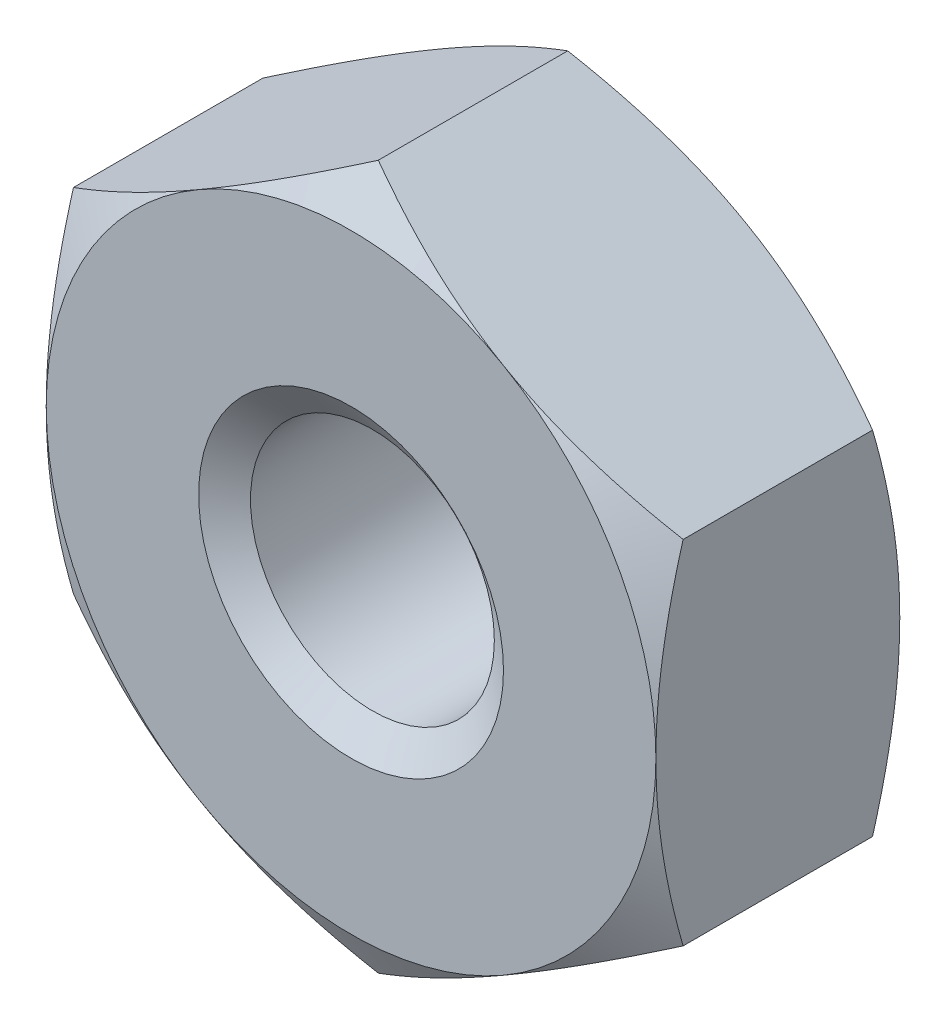
ISO-10303-21;
HEADER;
FILE_DESCRIPTION(('STEP AP214'),'2;1');
FILE_NAME('part.step','',(''),(''),'','','');
FILE_SCHEMA(('AUTOMOTIVE_DESIGN { 1 0 10303 214 1 1 1 1 }'));
ENDSEC;
DATA;
#1=APPLICATION_CONTEXT('core data for automotive mechanical design processes');
#2=APPLICATION_PROTOCOL_DEFINITION('international standard','automotive_design',2000,#1);
#3=PRODUCT_CONTEXT('',#1,'mechanical');
#4=PRODUCT('Part','Part','',(#3));
#5=PRODUCT_RELATED_PRODUCT_CATEGORY('part','',(#4));
#6=PRODUCT_DEFINITION_FORMATION('','',#4);
#7=PRODUCT_DEFINITION_CONTEXT('part definition',#1,'design');
#8=PRODUCT_DEFINITION('design','',#6,#7);
#9=PRODUCT_DEFINITION_SHAPE('','',#8);
#10=(LENGTH_UNIT() NAMED_UNIT(*) SI_UNIT(.MILLI.,.METRE.));
#11=(NAMED_UNIT(*) PLANE_ANGLE_UNIT() SI_UNIT($,.RADIAN.));
#12=(NAMED_UNIT(*) SI_UNIT($,.STERADIAN.) SOLID_ANGLE_UNIT());
#13=UNCERTAINTY_MEASURE_WITH_UNIT(LENGTH_MEASURE(1.E-05),#10,'distance_accuracy_value','');
#14=(GEOMETRIC_REPRESENTATION_CONTEXT(3) GLOBAL_UNCERTAINTY_ASSIGNED_CONTEXT((#13)) GLOBAL_UNIT_ASSIGNED_CONTEXT((#10,
#11,#12)) REPRESENTATION_CONTEXT('',''));
#15=CARTESIAN_POINT('',(0.,0.,0.));
#16=DIRECTION('',(0.,0.,1.));
#17=DIRECTION('',(1.,0.,0.));
#18=AXIS2_PLACEMENT_3D('',#15,#16,#17);
#19=CARTESIAN_POINT('',(0.,0.,-1.6));
#20=DIRECTION('',(0.,0.,1.));
#21=DIRECTION('',(1.,0.,0.));
#22=AXIS2_PLACEMENT_3D('',#19,#20,#21);
#23=CYLINDRICAL_SURFACE('',#22,0.8);
#24=CARTESIAN_POINT('',(0.,0.,-0.140041507641943));
#25=DIRECTION('',(0.,0.,1.));
#26=DIRECTION('',(1.,0.,0.));
#27=AXIS2_PLACEMENT_3D('',#24,#25,#26);
#28=CIRCLE('',#27,0.8);
#29=CARTESIAN_POINT('',(0.8,0.,-0.140041507641943));
#30=VERTEX_POINT('',#29);
#31=EDGE_CURVE('E175',#30,#30,#28,.F.);
#32=ORIENTED_EDGE('',*,*,#31,.F.);
#33=EDGE_LOOP('',(#32));
#34=FACE_BOUND('',#33,.T.);
#35=CARTESIAN_POINT('',(0.,0.,-1.43455849235806));
#36=DIRECTION('',(0.,0.,-1.));
#37=DIRECTION('',(-1.,0.,0.));
#38=AXIS2_PLACEMENT_3D('',#35,#36,#37);
#39=CIRCLE('',#38,0.8);
#40=CARTESIAN_POINT('',(-0.8,0.,-1.43455849235806));
#41=VERTEX_POINT('',#40);
#42=EDGE_CURVE('E39',#41,#41,#39,.F.);
#43=ORIENTED_EDGE('',*,*,#42,.F.);
#44=EDGE_LOOP('',(#43));
#45=FACE_BOUND('',#44,.T.);
#46=ADVANCED_FACE('F34',(#34,#45),#23,.F.);
#47=CARTESIAN_POINT('',(0.,2.30940107675851,-1.6));
#48=DIRECTION('',(-0.500000000000002,0.866025403784437,0.));
#49=DIRECTION('',(-0.866025403784437,-0.500000000000002,0.));
#50=AXIS2_PLACEMENT_3D('',#47,#48,#49);
#51=PLANE('',#50);
#52=DIRECTION('',(0.,0.,1.));
#53=VECTOR('',#52,1.);
#54=CARTESIAN_POINT('',(-2.,1.15470053837925,-1.6));
#55=LINE('',#54,#53);
#56=CARTESIAN_POINT('',(-2.,1.15470053837926,-1.42136720504592));
#57=VERTEX_POINT('',#56);
#58=CARTESIAN_POINT('',(-2.,1.15470053837925,-0.178632794954081));
#59=VERTEX_POINT('',#58);
#60=EDGE_CURVE('E165',#57,#59,#55,.T.);
#61=ORIENTED_EDGE('',*,*,#60,.T.);
#62=CARTESIAN_POINT('',(-2.0002,1.15458506832541,-0.178699466620498));
#63=CARTESIAN_POINT('',(-1.91230873709994,1.20532911262018,-0.149389536100679));
#64=CARTESIAN_POINT('',(-1.82365880552641,1.2565111744778,-0.122732851980467));
#65=CARTESIAN_POINT('',(-1.6448237530022,1.35976164019319,-0.0762024910207208));
#66=CARTESIAN_POINT('',(-1.55463545349496,1.41183187919145,-0.0563452763827788));
#67=CARTESIAN_POINT('',(-1.37537661423669,1.51532701829183,-0.0254334640232523));
#68=CARTESIAN_POINT('',(-1.2863336617737,1.56673599086578,-0.014173151598531));
#69=CARTESIAN_POINT('',(-1.10782860221496,1.66979593505373,-0.000728662594641892));
#70=CARTESIAN_POINT('',(-1.01836714429604,1.72144653186531,0.00146664504653178));
#71=CARTESIAN_POINT('',(-0.851191646451203,1.81796535054794,-0.00309098933064907));
#72=CARTESIAN_POINT('',(-0.773452629734218,1.86284799277603,-0.0087248746870151));
#73=CARTESIAN_POINT('',(-0.618481085463868,1.95232085557725,-0.0265838952608293));
#74=CARTESIAN_POINT('',(-0.541249094258803,1.99691076648954,-0.0388151360234404));
#75=CARTESIAN_POINT('',(-0.3859578135178,2.08656822922816,-0.0693934368676112));
#76=CARTESIAN_POINT('',(-0.307918186892622,2.13162442866767,-0.0878701670657176));
#77=CARTESIAN_POINT('',(-0.153003134307866,2.221064675979,-0.129805518212858));
#78=CARTESIAN_POINT('',(-0.0761257223768808,2.26544987045196,-0.153254280492316));
#79=CARTESIAN_POINT('',(0.000199999999999008,2.30951654681234,-0.1786994666205));
#80=B_SPLINE_CURVE_WITH_KNOTS('',3,(#62,#63,#64,#65,#66,#67,#68,#69,#70,#71,#72,#73,#74,#75,#76,
#77,#78,#79),.UNSPECIFIED.,.F.,.F.,(4,2,2,2,2,2,2,2,4),(0.,0.31703182469561,0.634825876346564,
0.944753967652636,1.25430138000371,1.52387047293094,1.79368946861028,2.06949491027634,
2.34475850821473),.UNSPECIFIED.);
#81=CARTESIAN_POINT('',(-1.,1.73205080756887,0.));
#82=VERTEX_POINT('',#81);
#83=EDGE_CURVE('E61',#59,#82,#80,.T.);
#84=ORIENTED_EDGE('',*,*,#83,.T.);
#85=CARTESIAN_POINT('',(0.,2.30940107675851,-0.178632794954084));
#86=VERTEX_POINT('',#85);
#87=EDGE_CURVE('E239',#82,#86,#80,.T.);
#88=ORIENTED_EDGE('',*,*,#87,.T.);
#89=DIRECTION('',(0.,0.,1.));
#90=VECTOR('',#89,1.);
#91=CARTESIAN_POINT('',(0.,2.30940107675851,-1.6));
#92=LINE('',#91,#90);
#93=CARTESIAN_POINT('',(0.,2.30940107675851,-1.42136720504592));
#94=VERTEX_POINT('',#93);
#95=EDGE_CURVE('E150',#94,#86,#92,.T.);
#96=ORIENTED_EDGE('',*,*,#95,.F.);
#97=CARTESIAN_POINT('',(-2.0002,1.15458506832541,-1.4213005333795));
#98=CARTESIAN_POINT('',(-1.91230873709994,1.20532911262018,-1.45061046389932));
#99=CARTESIAN_POINT('',(-1.82365880552641,1.2565111744778,-1.47726714801953));
#100=CARTESIAN_POINT('',(-1.6448237530022,1.35976164019319,-1.52379750897928));
#101=CARTESIAN_POINT('',(-1.55463545349496,1.41183187919145,-1.54365472361722));
#102=CARTESIAN_POINT('',(-1.37537661423669,1.51532701829183,-1.57456653597675));
#103=CARTESIAN_POINT('',(-1.2863336617737,1.56673599086578,-1.58582684840147));
#104=CARTESIAN_POINT('',(-1.10782860221496,1.66979593505373,-1.59927133740536));
#105=CARTESIAN_POINT('',(-1.01836714429604,1.72144653186531,-1.60146664504653));
#106=CARTESIAN_POINT('',(-0.851191646451203,1.81796535054794,-1.59690901066935));
#107=CARTESIAN_POINT('',(-0.773452629734218,1.86284799277603,-1.59127512531298));
#108=CARTESIAN_POINT('',(-0.618481085463868,1.95232085557725,-1.57341610473917));
#109=CARTESIAN_POINT('',(-0.541249094258803,1.99691076648954,-1.56118486397656));
#110=CARTESIAN_POINT('',(-0.3859578135178,2.08656822922816,-1.53060656313239));
#111=CARTESIAN_POINT('',(-0.307918186892621,2.13162442866767,-1.51212983293428));
#112=CARTESIAN_POINT('',(-0.153003134307866,2.221064675979,-1.47019448178714));
#113=CARTESIAN_POINT('',(-0.0761257223768808,2.26544987045196,-1.44674571950768));
#114=CARTESIAN_POINT('',(0.000199999999999011,2.30951654681234,-1.4213005333795));
#115=B_SPLINE_CURVE_WITH_KNOTS('',3,(#97,#98,#99,#100,#101,#102,#103,#104,#105,#106,#107,#108,
#109,#110,#111,#112,#113,#114),.UNSPECIFIED.,.F.,.F.,(4,2,2,2,2,2,2,2,4),(0.,0.31703182469561,
0.634825876346564,0.944753967652636,1.25430138000371,1.52387047293094,1.79368946861028,
2.06949491027634,2.34475850821473),.UNSPECIFIED.);
#116=CARTESIAN_POINT('',(-1.,1.73205080756887,-1.6));
#117=VERTEX_POINT('',#116);
#118=EDGE_CURVE('E168',#117,#94,#115,.T.);
#119=ORIENTED_EDGE('',*,*,#118,.F.);
#120=EDGE_CURVE('E260',#57,#117,#115,.T.);
#121=ORIENTED_EDGE('',*,*,#120,.F.);
#122=EDGE_LOOP('',(#61,#84,#88,#96,#119,#121));
#123=FACE_BOUND('',#122,.T.);
#124=ADVANCED_FACE('F36',(#123),#51,.T.);
#125=CARTESIAN_POINT('',(2.,1.15470053837925,-1.6));
#126=DIRECTION('',(0.500000000000002,0.866025403784438,0.));
#127=DIRECTION('',(-0.866025403784438,0.500000000000002,0.));
#128=AXIS2_PLACEMENT_3D('',#125,#126,#127);
#129=PLANE('',#128);
#130=ORIENTED_EDGE('',*,*,#95,.T.);
#131=CARTESIAN_POINT('',(-0.000200000000000964,2.30951654681234,-0.1786994666205));
#132=CARTESIAN_POINT('',(0.0876912629000591,2.25877250251758,-0.149389536100681));
#133=CARTESIAN_POINT('',(0.17634119447359,2.20759044065996,-0.122732851980469));
#134=CARTESIAN_POINT('',(0.355176246997801,2.10433997494456,-0.0762024910207226));
#135=CARTESIAN_POINT('',(0.445364546505036,2.05226973594631,-0.0563452763827806));
#136=CARTESIAN_POINT('',(0.624623385763305,1.94877459684592,-0.0254334640232534));
#137=CARTESIAN_POINT('',(0.713666338226303,1.89736562427197,-0.0141731515985316));
#138=CARTESIAN_POINT('',(0.892171397785042,1.79430568008402,-0.000728662594641981));
#139=CARTESIAN_POINT('',(0.981632855703957,1.74265508327244,0.00146664504653164));
#140=CARTESIAN_POINT('',(1.1488083535488,1.64613626458981,-0.00309098933064877));
#141=CARTESIAN_POINT('',(1.22654737026578,1.60125362236172,-0.00872487468701434));
#142=CARTESIAN_POINT('',(1.38151891453613,1.51178075956051,-0.026583895260828));
#143=CARTESIAN_POINT('',(1.4587509057412,1.46719084864821,-0.0388151360234391));
#144=CARTESIAN_POINT('',(1.6140421864822,1.37753338590959,-0.0693934368676097));
#145=CARTESIAN_POINT('',(1.69208181310738,1.33247718647009,-0.0878701670657158));
#146=CARTESIAN_POINT('',(1.84699686569213,1.24303693915875,-0.129805518212856));
#147=CARTESIAN_POINT('',(1.92387427762312,1.1986517446858,-0.153254280492314));
#148=CARTESIAN_POINT('',(2.0002,1.15458506832541,-0.178699466620498));
#149=B_SPLINE_CURVE_WITH_KNOTS('',3,(#131,#132,#133,#134,#135,#136,#137,#138,#139,#140,#141,
#142,#143,#144,#145,#146,#147,#148),.UNSPECIFIED.,.F.,.F.,(4,2,2,2,2,2,2,2,4),(0.,
0.31703182469561,0.634825876346565,0.944753967652637,1.25430138000371,1.52387047293094,
1.79368946861029,2.06949491027634,2.34475850821473),.UNSPECIFIED.);
#150=CARTESIAN_POINT('',(1.,1.73205080756888,0.));
#151=VERTEX_POINT('',#150);
#152=EDGE_CURVE('E143',#86,#151,#149,.T.);
#153=ORIENTED_EDGE('',*,*,#152,.T.);
#154=CARTESIAN_POINT('',(2.,1.15470053837926,-0.178632794954084));
#155=VERTEX_POINT('',#154);
#156=EDGE_CURVE('E129',#151,#155,#149,.T.);
#157=ORIENTED_EDGE('',*,*,#156,.T.);
#158=DIRECTION('',(0.,0.,1.));
#159=VECTOR('',#158,1.);
#160=CARTESIAN_POINT('',(2.,1.15470053837925,-1.6));
#161=LINE('',#160,#159);
#162=CARTESIAN_POINT('',(2.,1.15470053837926,-1.42136720504592));
#163=VERTEX_POINT('',#162);
#164=EDGE_CURVE('E142',#163,#155,#161,.T.);
#165=ORIENTED_EDGE('',*,*,#164,.F.);
#166=CARTESIAN_POINT('',(-0.000200000000000964,2.30951654681234,-1.4213005333795));
#167=CARTESIAN_POINT('',(0.0876912629000591,2.25877250251758,-1.45061046389932));
#168=CARTESIAN_POINT('',(0.17634119447359,2.20759044065996,-1.47726714801953));
#169=CARTESIAN_POINT('',(0.355176246997801,2.10433997494456,-1.52379750897928));
#170=CARTESIAN_POINT('',(0.445364546505036,2.05226973594631,-1.54365472361722));
#171=CARTESIAN_POINT('',(0.624623385763305,1.94877459684592,-1.57456653597675));
#172=CARTESIAN_POINT('',(0.713666338226303,1.89736562427197,-1.58582684840147));
#173=CARTESIAN_POINT('',(0.892171397785042,1.79430568008402,-1.59927133740536));
#174=CARTESIAN_POINT('',(0.981632855703957,1.74265508327244,-1.60146664504653));
#175=CARTESIAN_POINT('',(1.1488083535488,1.64613626458981,-1.59690901066935));
#176=CARTESIAN_POINT('',(1.22654737026578,1.60125362236172,-1.59127512531299));
#177=CARTESIAN_POINT('',(1.38151891453613,1.51178075956051,-1.57341610473917));
#178=CARTESIAN_POINT('',(1.4587509057412,1.46719084864821,-1.56118486397656));
#179=CARTESIAN_POINT('',(1.6140421864822,1.37753338590959,-1.53060656313239));
#180=CARTESIAN_POINT('',(1.69208181310738,1.33247718647009,-1.51212983293428));
#181=CARTESIAN_POINT('',(1.84699686569213,1.24303693915875,-1.47019448178714));
#182=CARTESIAN_POINT('',(1.92387427762312,1.1986517446858,-1.44674571950769));
#183=CARTESIAN_POINT('',(2.0002,1.15458506832541,-1.4213005333795));
#184=B_SPLINE_CURVE_WITH_KNOTS('',3,(#166,#167,#168,#169,#170,#171,#172,#173,#174,#175,#176,
#177,#178,#179,#180,#181,#182,#183),.UNSPECIFIED.,.F.,.F.,(4,2,2,2,2,2,2,2,4),(0.,
0.31703182469561,0.634825876346565,0.944753967652637,1.25430138000371,1.52387047293094,
1.79368946861029,2.06949491027634,2.34475850821473),.UNSPECIFIED.);
#185=CARTESIAN_POINT('',(1.,1.73205080756888,-1.6));
#186=VERTEX_POINT('',#185);
#187=EDGE_CURVE('E254',#186,#163,#184,.T.);
#188=ORIENTED_EDGE('',*,*,#187,.F.);
#189=EDGE_CURVE('E259',#94,#186,#184,.T.);
#190=ORIENTED_EDGE('',*,*,#189,.F.);
#191=EDGE_LOOP('',(#130,#153,#157,#165,#188,#190));
#192=FACE_BOUND('',#191,.T.);
#193=ADVANCED_FACE('F140',(#192),#129,.T.);
#194=CARTESIAN_POINT('',(2.,1.15470053837925,-1.6));
#195=DIRECTION('',(-1.,0.,0.));
#196=DIRECTION('',(0.,0.,1.));
#197=AXIS2_PLACEMENT_3D('',#194,#195,#196);
#198=PLANE('',#197);
#199=CARTESIAN_POINT('',(2.,-3.06243599497946,-0.957053410620322));
#200=CARTESIAN_POINT('',(2.,-2.97462468513202,-0.914618135332453));
#201=CARTESIAN_POINT('',(2.,-2.88660576044575,-0.8726047018782));
#202=CARTESIAN_POINT('',(2.,-2.71004042392047,-0.78966257342409));
#203=CARTESIAN_POINT('',(2.,-2.62149392396103,-0.748734066234634));
#204=CARTESIAN_POINT('',(2.,-2.44328285836994,-0.667987231477973));
#205=CARTESIAN_POINT('',(2.,-2.3536147942302,-0.628176597351501));
#206=CARTESIAN_POINT('',(2.,-2.17354167395292,-0.55026529289016));
#207=CARTESIAN_POINT('',(2.,-2.08313665652235,-0.512164533422732));
#208=CARTESIAN_POINT('',(2.,-1.90031404940485,-0.437671460362099));
#209=CARTESIAN_POINT('',(2.,-1.80788540023434,-0.401306140224328));
#210=CARTESIAN_POINT('',(2.,-1.62195694964761,-0.331431205515075));
#211=CARTESIAN_POINT('',(2.,-1.52845725096658,-0.297921319609402));
#212=CARTESIAN_POINT('',(2.,-1.34040158791134,-0.234645877627144));
#213=CARTESIAN_POINT('',(2.,-1.24584820361334,-0.204872731943686));
#214=CARTESIAN_POINT('',(2.,-1.05539728812543,-0.150041663725098));
#215=CARTESIAN_POINT('',(2.,-0.959500192348566,-0.124982250068513));
#216=CARTESIAN_POINT('',(2.,-0.766296107056178,-0.0807954522614523));
#217=CARTESIAN_POINT('',(2.,-0.668988749343055,-0.0616696475902398));
#218=CARTESIAN_POINT('',(2.,-0.473201573751663,-0.0306369133490222));
#219=CARTESIAN_POINT('',(2.,-0.374721754836869,-0.0187299901614157));
#220=CARTESIAN_POINT('',(2.,-0.17772521301446,-0.00319166535968527));
#221=CARTESIAN_POINT('',(2.,-0.0792127464695967,0.000492126942978357));
#222=CARTESIAN_POINT('',(2.,0.117733134481543,-0.000599210482845822));
#223=CARTESIAN_POINT('',(2.,0.216166562771041,-0.00537214444611022));
#224=CARTESIAN_POINT('',(2.,0.454297223248122,-0.0267243139120263));
#225=CARTESIAN_POINT('',(2.,0.593620477818537,-0.0474829418890643));
#226=CARTESIAN_POINT('',(2.,0.86968930625477,-0.102199494270679));
#227=CARTESIAN_POINT('',(2.,1.00643164818021,-0.136172948124204));
#228=CARTESIAN_POINT('',(2.,1.21108706615394,-0.194758945655361));
#229=CARTESIAN_POINT('',(2.,1.28004655189501,-0.215857177032566));
#230=CARTESIAN_POINT('',(2.,1.41724192464572,-0.260142084128327));
#231=CARTESIAN_POINT('',(2.,1.48547827495748,-0.283327319381157));
#232=CARTESIAN_POINT('',(2.,1.62094688255353,-0.331302907971969));
#233=CARTESIAN_POINT('',(2.,1.68818262968755,-0.356083492073602));
#234=CARTESIAN_POINT('',(2.,1.82213246587634,-0.407099147686615));
#235=CARTESIAN_POINT('',(2.,1.88884633148565,-0.433334807052327));
#236=CARTESIAN_POINT('',(2.,1.95531849493342,-0.460154503270896));
#237=B_SPLINE_CURVE_WITH_KNOTS('',3,(#199,#200,#201,#202,#203,#204,#205,#206,#207,#208,#209,
#210,#211,#212,#213,#214,#215,#216,#217,#218,#219,#220,#221,#222,#223,#224,#225,#226,#227,#228,
#229,#230,#231,#232,#233,#234,#235,#236),.UNSPECIFIED.,.F.,.F.,(4,2,2,2,2,2,2,2,2,2,2,2,2,2,2,2,
2,2,4),(0.,0.292585896266136,0.585222115299634,0.879532973229949,1.17382847142413,
1.47176772581358,1.76967863724007,2.06697432467463,2.36417580814398,2.66145633652585,
2.95873712774069,3.25411843045681,3.54942304948606,3.97114178181684,4.39335760296179,
4.60967655565109,4.82584733174413,5.04080135347749,5.25584285892498),.UNSPECIFIED.);
#238=CARTESIAN_POINT('',(2.,-1.15470053837926,-0.178632794954084));
#239=VERTEX_POINT('',#238);
#240=CARTESIAN_POINT('',(2.,0.,0.));
#241=VERTEX_POINT('',#240);
#242=EDGE_CURVE('E135',#239,#241,#237,.T.);
#243=ORIENTED_EDGE('',*,*,#242,.F.);
#244=DIRECTION('',(0.,0.,1.));
#245=VECTOR('',#244,1.);
#246=CARTESIAN_POINT('',(2.,-1.15470053837926,-1.6));
#247=LINE('',#246,#245);
#248=CARTESIAN_POINT('',(2.,-1.15470053837926,-1.42136720504592));
#249=VERTEX_POINT('',#248);
#250=EDGE_CURVE('E151',#249,#239,#247,.T.);
#251=ORIENTED_EDGE('',*,*,#250,.F.);
#252=CARTESIAN_POINT('',(2.,-3.06243599497946,-0.642946589379678));
#253=CARTESIAN_POINT('',(2.,-2.97462468513202,-0.685381864667547));
#254=CARTESIAN_POINT('',(2.,-2.88660576044575,-0.7273952981218));
#255=CARTESIAN_POINT('',(2.,-2.71004042392047,-0.81033742657591));
#256=CARTESIAN_POINT('',(2.,-2.62149392396103,-0.851265933765366));
#257=CARTESIAN_POINT('',(2.,-2.44328285836994,-0.932012768522027));
#258=CARTESIAN_POINT('',(2.,-2.3536147942302,-0.971823402648499));
#259=CARTESIAN_POINT('',(2.,-2.17354167395292,-1.04973470710984));
#260=CARTESIAN_POINT('',(2.,-2.08313665652235,-1.08783546657727));
#261=CARTESIAN_POINT('',(2.,-1.90031404940485,-1.1623285396379));
#262=CARTESIAN_POINT('',(2.,-1.80788540023434,-1.19869385977567));
#263=CARTESIAN_POINT('',(2.,-1.62195694964761,-1.26856879448492));
#264=CARTESIAN_POINT('',(2.,-1.52845725096658,-1.3020786803906));
#265=CARTESIAN_POINT('',(2.,-1.34040158791134,-1.36535412237286));
#266=CARTESIAN_POINT('',(2.,-1.24584820361334,-1.39512726805631));
#267=CARTESIAN_POINT('',(2.,-1.05539728812543,-1.4499583362749));
#268=CARTESIAN_POINT('',(2.,-0.959500192348566,-1.47501774993149));
#269=CARTESIAN_POINT('',(2.,-0.766296107056178,-1.51920454773855));
#270=CARTESIAN_POINT('',(2.,-0.668988749343055,-1.53833035240976));
#271=CARTESIAN_POINT('',(2.,-0.473201573751663,-1.56936308665098));
#272=CARTESIAN_POINT('',(2.,-0.37472175483687,-1.58127000983858));
#273=CARTESIAN_POINT('',(2.,-0.17772521301446,-1.59680833464032));
#274=CARTESIAN_POINT('',(2.,-0.079212746469597,-1.60049212694298));
#275=CARTESIAN_POINT('',(2.,0.117733134481543,-1.59940078951715));
#276=CARTESIAN_POINT('',(2.,0.216166562771041,-1.59462785555389));
#277=CARTESIAN_POINT('',(2.,0.454297223248122,-1.57327568608797));
#278=CARTESIAN_POINT('',(2.,0.593620477818536,-1.55251705811094));
#279=CARTESIAN_POINT('',(2.,0.86968930625477,-1.49780050572932));
#280=CARTESIAN_POINT('',(2.,1.00643164818021,-1.4638270518758));
#281=CARTESIAN_POINT('',(2.,1.21108706615394,-1.40524105434464));
#282=CARTESIAN_POINT('',(2.,1.28004655189501,-1.38414282296743));
#283=CARTESIAN_POINT('',(2.,1.41724192464572,-1.33985791587167));
#284=CARTESIAN_POINT('',(2.,1.48547827495748,-1.31667268061884));
#285=CARTESIAN_POINT('',(2.,1.62094688255353,-1.26869709202803));
#286=CARTESIAN_POINT('',(2.,1.68818262968755,-1.2439165079264));
#287=CARTESIAN_POINT('',(2.,1.82213246587634,-1.19290085231338));
#288=CARTESIAN_POINT('',(2.,1.88884633148565,-1.16666519294767));
#289=CARTESIAN_POINT('',(2.,1.95531849493342,-1.1398454967291));
#290=B_SPLINE_CURVE_WITH_KNOTS('',3,(#252,#253,#254,#255,#256,#257,#258,#259,#260,#261,#262,
#263,#264,#265,#266,#267,#268,#269,#270,#271,#272,#273,#274,#275,#276,#277,#278,#279,#280,#281,
#282,#283,#284,#285,#286,#287,#288,#289),.UNSPECIFIED.,.F.,.F.,(4,2,2,2,2,2,2,2,2,2,2,2,2,2,2,2,
2,2,4),(0.,0.292585896266135,0.585222115299633,0.879532973229948,1.17382847142413,
1.47176772581358,1.76967863724007,2.06697432467463,2.36417580814398,2.66145633652585,
2.95873712774069,3.25411843045681,3.54942304948606,3.97114178181684,4.39335760296179,
4.60967655565109,4.82584733174413,5.04080135347749,5.25584285892498),.UNSPECIFIED.);
#291=CARTESIAN_POINT('',(2.,0.,-1.6));
#292=VERTEX_POINT('',#291);
#293=EDGE_CURVE('E265',#249,#292,#290,.T.);
#294=ORIENTED_EDGE('',*,*,#293,.T.);
#295=EDGE_CURVE('E149',#292,#163,#290,.T.);
#296=ORIENTED_EDGE('',*,*,#295,.T.);
#297=ORIENTED_EDGE('',*,*,#164,.T.);
#298=EDGE_CURVE('E126',#241,#155,#237,.T.);
#299=ORIENTED_EDGE('',*,*,#298,.F.);
#300=EDGE_LOOP('',(#243,#251,#294,#296,#297,#299));
#301=FACE_BOUND('',#300,.T.);
#302=ADVANCED_FACE('F146',(#301),#198,.F.);
#303=CARTESIAN_POINT('',(0.,-2.30940107675851,-1.6));
#304=DIRECTION('',(0.500000000000002,-0.866025403784438,0.));
#305=DIRECTION('',(0.866025403784438,0.500000000000002,0.));
#306=AXIS2_PLACEMENT_3D('',#303,#304,#305);
#307=PLANE('',#306);
#308=ORIENTED_EDGE('',*,*,#250,.T.);
#309=CARTESIAN_POINT('',(2.0002,-1.15458506832542,-0.178699466620501));
#310=CARTESIAN_POINT('',(1.91230873709994,-1.20532911262019,-0.149389536100682));
#311=CARTESIAN_POINT('',(1.82365880552641,-1.25651117447781,-0.12273285198047));
#312=CARTESIAN_POINT('',(1.6448237530022,-1.3597616401932,-0.076202491020724));
#313=CARTESIAN_POINT('',(1.55463545349496,-1.41183187919146,-0.0563452763827822));
#314=CARTESIAN_POINT('',(1.37537661423669,-1.51532701829184,-0.025433464023256));
#315=CARTESIAN_POINT('',(1.2863336617737,-1.56673599086579,-0.014173151598535));
#316=CARTESIAN_POINT('',(1.10782860221496,-1.66979593505374,-0.000728662594646239));
#317=CARTESIAN_POINT('',(1.01836714429604,-1.72144653186532,0.00146664504652725));
#318=CARTESIAN_POINT('',(0.851191646451201,-1.81796535054795,-0.00309098933065391));
#319=CARTESIAN_POINT('',(0.773452629734216,-1.86284799277604,-0.00872487468702002));
#320=CARTESIAN_POINT('',(0.618481085463866,-1.95232085557726,-0.0265838952608342));
#321=CARTESIAN_POINT('',(0.541249094258801,-1.99691076648955,-0.0388151360234453));
#322=CARTESIAN_POINT('',(0.385957813517799,-2.08656822922817,-0.0693934368676162));
#323=CARTESIAN_POINT('',(0.30791818689262,-2.13162442866768,-0.0878701670657225));
#324=CARTESIAN_POINT('',(0.153003134307865,-2.22106467597901,-0.129805518212863));
#325=CARTESIAN_POINT('',(0.0761257223768798,-2.26544987045197,-0.153254280492321));
#326=CARTESIAN_POINT('',(-0.000200000000000013,-2.30951654681235,-0.178699466620505));
#327=B_SPLINE_CURVE_WITH_KNOTS('',3,(#309,#310,#311,#312,#313,#314,#315,#316,#317,#318,#319,
#320,#321,#322,#323,#324,#325,#326),.UNSPECIFIED.,.F.,.F.,(4,2,2,2,2,2,2,2,4),(0.,
0.317031824695611,0.634825876346565,0.944753967652638,1.25430138000371,1.52387047293094,
1.79368946861029,2.06949491027634,2.34475850821473),.UNSPECIFIED.);
#328=CARTESIAN_POINT('',(1.,-1.73205080756888,0.));
#329=VERTEX_POINT('',#328);
#330=EDGE_CURVE('E536',#239,#329,#327,.T.);
#331=ORIENTED_EDGE('',*,*,#330,.T.);
#332=CARTESIAN_POINT('',(0.,-2.30940107675851,-0.178632794954084));
#333=VERTEX_POINT('',#332);
#334=EDGE_CURVE('E226',#329,#333,#327,.T.);
#335=ORIENTED_EDGE('',*,*,#334,.T.);
#336=DIRECTION('',(0.,0.,1.));
#337=VECTOR('',#336,1.);
#338=CARTESIAN_POINT('',(0.,-2.30940107675851,-1.6));
#339=LINE('',#338,#337);
#340=CARTESIAN_POINT('',(0.,-2.30940107675851,-1.42136720504592));
#341=VERTEX_POINT('',#340);
#342=EDGE_CURVE('E156',#341,#333,#339,.T.);
#343=ORIENTED_EDGE('',*,*,#342,.F.);
#344=CARTESIAN_POINT('',(2.0002,-1.15458506832542,-1.4213005333795));
#345=CARTESIAN_POINT('',(1.91230873709994,-1.20532911262019,-1.45061046389932));
#346=CARTESIAN_POINT('',(1.82365880552641,-1.25651117447781,-1.47726714801953));
#347=CARTESIAN_POINT('',(1.6448237530022,-1.3597616401932,-1.52379750897928));
#348=CARTESIAN_POINT('',(1.55463545349496,-1.41183187919146,-1.54365472361722));
#349=CARTESIAN_POINT('',(1.37537661423669,-1.51532701829184,-1.57456653597674));
#350=CARTESIAN_POINT('',(1.2863336617737,-1.56673599086579,-1.58582684840147));
#351=CARTESIAN_POINT('',(1.10782860221496,-1.66979593505374,-1.59927133740535));
#352=CARTESIAN_POINT('',(1.01836714429604,-1.72144653186532,-1.60146664504653));
#353=CARTESIAN_POINT('',(0.851191646451201,-1.81796535054795,-1.59690901066935));
#354=CARTESIAN_POINT('',(0.773452629734216,-1.86284799277604,-1.59127512531298));
#355=CARTESIAN_POINT('',(0.618481085463866,-1.95232085557726,-1.57341610473917));
#356=CARTESIAN_POINT('',(0.541249094258801,-1.99691076648955,-1.56118486397655));
#357=CARTESIAN_POINT('',(0.385957813517799,-2.08656822922817,-1.53060656313238));
#358=CARTESIAN_POINT('',(0.30791818689262,-2.13162442866768,-1.51212983293428));
#359=CARTESIAN_POINT('',(0.153003134307866,-2.22106467597901,-1.47019448178714));
#360=CARTESIAN_POINT('',(0.0761257223768803,-2.26544987045197,-1.44674571950768));
#361=CARTESIAN_POINT('',(-0.000199999999999683,-2.30951654681235,-1.42130053337949));
#362=B_SPLINE_CURVE_WITH_KNOTS('',3,(#344,#345,#346,#347,#348,#349,#350,#351,#352,#353,#354,
#355,#356,#357,#358,#359,#360,#361),.UNSPECIFIED.,.F.,.F.,(4,2,2,2,2,2,2,2,4),(0.,
0.317031824695611,0.634825876346565,0.944753967652638,1.25430138000371,1.52387047293094,
1.79368946861029,2.06949491027634,2.34475850821473),.UNSPECIFIED.);
#363=CARTESIAN_POINT('',(1.,-1.73205080756888,-1.6));
#364=VERTEX_POINT('',#363);
#365=EDGE_CURVE('E271',#364,#341,#362,.T.);
#366=ORIENTED_EDGE('',*,*,#365,.F.);
#367=EDGE_CURVE('E270',#249,#364,#362,.T.);
#368=ORIENTED_EDGE('',*,*,#367,.F.);
#369=EDGE_LOOP('',(#308,#331,#335,#343,#366,#368));
#370=FACE_BOUND('',#369,.T.);
#371=ADVANCED_FACE('F281',(#370),#307,.T.);
#372=CARTESIAN_POINT('',(-2.,-1.15470053837926,-1.6));
#373=DIRECTION('',(-0.500000000000002,-0.866025403784438,0.));
#374=DIRECTION('',(0.866025403784438,-0.500000000000002,0.));
#375=AXIS2_PLACEMENT_3D('',#372,#373,#374);
#376=PLANE('',#375);
#377=ORIENTED_EDGE('',*,*,#342,.T.);
#378=CARTESIAN_POINT('',(0.000200000000000188,-2.30951654681235,-0.178699466620505));
#379=CARTESIAN_POINT('',(-0.0876912629000603,-2.25877250251759,-0.149389536100686));
#380=CARTESIAN_POINT('',(-0.176341194473592,-2.20759044065997,-0.122732851980474));
#381=CARTESIAN_POINT('',(-0.355176246997803,-2.10433997494457,-0.0762024910207271));
#382=CARTESIAN_POINT('',(-0.445364546505038,-2.05226973594631,-0.0563452763827848));
#383=CARTESIAN_POINT('',(-0.624623385763308,-1.94877459684593,-0.0254334640232577));
#384=CARTESIAN_POINT('',(-0.713666338226307,-1.89736562427198,-0.0141731515985362));
#385=CARTESIAN_POINT('',(-0.892171397785047,-1.79430568008403,-0.000728662594646636));
#386=CARTESIAN_POINT('',(-0.981632855703962,-1.74265508327245,0.0014666450465272));
#387=CARTESIAN_POINT('',(-1.1488083535488,-1.64613626458982,-0.00309098933065326));
#388=CARTESIAN_POINT('',(-1.22654737026579,-1.60125362236173,-0.00872487468701898));
#389=CARTESIAN_POINT('',(-1.38151891453614,-1.51178075956051,-0.0265838952608325));
#390=CARTESIAN_POINT('',(-1.4587509057412,-1.46719084864822,-0.0388151360234433));
#391=CARTESIAN_POINT('',(-1.6140421864822,-1.3775333859096,-0.0693934368676135));
#392=CARTESIAN_POINT('',(-1.69208181310738,-1.33247718647009,-0.0878701670657195));
#393=CARTESIAN_POINT('',(-1.84699686569214,-1.24303693915876,-0.129805518212859));
#394=CARTESIAN_POINT('',(-1.92387427762312,-1.1986517446858,-0.153254280492317));
#395=CARTESIAN_POINT('',(-2.0002,-1.15458506832542,-0.178699466620501));
#396=B_SPLINE_CURVE_WITH_KNOTS('',3,(#378,#379,#380,#381,#382,#383,#384,#385,#386,#387,#388,
#389,#390,#391,#392,#393,#394,#395),.UNSPECIFIED.,.F.,.F.,(4,2,2,2,2,2,2,2,4),(0.,
0.317031824695612,0.634825876346567,0.944753967652641,1.25430138000372,1.52387047293094,
1.79368946861029,2.06949491027634,2.34475850821473),.UNSPECIFIED.);
#397=CARTESIAN_POINT('',(-1.,-1.73205080756888,0.));
#398=VERTEX_POINT('',#397);
#399=EDGE_CURVE('E534',#333,#398,#396,.T.);
#400=ORIENTED_EDGE('',*,*,#399,.T.);
#401=CARTESIAN_POINT('',(-2.,-1.15470053837926,-0.178632794954084));
#402=VERTEX_POINT('',#401);
#403=EDGE_CURVE('E199',#398,#402,#396,.T.);
#404=ORIENTED_EDGE('',*,*,#403,.T.);
#405=DIRECTION('',(0.,0.,1.));
#406=VECTOR('',#405,1.);
#407=CARTESIAN_POINT('',(-2.,-1.15470053837926,-1.6));
#408=LINE('',#407,#406);
#409=CARTESIAN_POINT('',(-2.,-1.15470053837926,-1.42136720504592));
#410=VERTEX_POINT('',#409);
#411=EDGE_CURVE('E162',#410,#402,#408,.T.);
#412=ORIENTED_EDGE('',*,*,#411,.F.);
#413=CARTESIAN_POINT('',(0.000200000000000188,-2.30951654681235,-1.42130053337949));
#414=CARTESIAN_POINT('',(-0.0876912629000603,-2.25877250251759,-1.45061046389931));
#415=CARTESIAN_POINT('',(-0.176341194473592,-2.20759044065997,-1.47726714801953));
#416=CARTESIAN_POINT('',(-0.355176246997803,-2.10433997494457,-1.52379750897927));
#417=CARTESIAN_POINT('',(-0.445364546505038,-2.05226973594631,-1.54365472361722));
#418=CARTESIAN_POINT('',(-0.624623385763308,-1.94877459684593,-1.57456653597674));
#419=CARTESIAN_POINT('',(-0.713666338226307,-1.89736562427198,-1.58582684840146));
#420=CARTESIAN_POINT('',(-0.892171397785047,-1.79430568008403,-1.59927133740535));
#421=CARTESIAN_POINT('',(-0.981632855703962,-1.74265508327245,-1.60146664504653));
#422=CARTESIAN_POINT('',(-1.1488083535488,-1.64613626458982,-1.59690901066935));
#423=CARTESIAN_POINT('',(-1.22654737026579,-1.60125362236173,-1.59127512531298));
#424=CARTESIAN_POINT('',(-1.38151891453614,-1.51178075956051,-1.57341610473917));
#425=CARTESIAN_POINT('',(-1.4587509057412,-1.46719084864822,-1.56118486397656));
#426=CARTESIAN_POINT('',(-1.6140421864822,-1.3775333859096,-1.53060656313239));
#427=CARTESIAN_POINT('',(-1.69208181310738,-1.33247718647009,-1.51212983293428));
#428=CARTESIAN_POINT('',(-1.84699686569214,-1.24303693915876,-1.47019448178714));
#429=CARTESIAN_POINT('',(-1.92387427762312,-1.1986517446858,-1.44674571950768));
#430=CARTESIAN_POINT('',(-2.0002,-1.15458506832542,-1.4213005333795));
#431=B_SPLINE_CURVE_WITH_KNOTS('',3,(#413,#414,#415,#416,#417,#418,#419,#420,#421,#422,#423,
#424,#425,#426,#427,#428,#429,#430),.UNSPECIFIED.,.F.,.F.,(4,2,2,2,2,2,2,2,4),(0.,
0.317031824695612,0.634825876346567,0.944753967652641,1.25430138000372,1.52387047293094,
1.79368946861029,2.06949491027634,2.34475850821473),.UNSPECIFIED.);
#432=CARTESIAN_POINT('',(-1.,-1.73205080756888,-1.6));
#433=VERTEX_POINT('',#432);
#434=EDGE_CURVE('E277',#433,#410,#431,.T.);
#435=ORIENTED_EDGE('',*,*,#434,.F.);
#436=EDGE_CURVE('E276',#341,#433,#431,.T.);
#437=ORIENTED_EDGE('',*,*,#436,.F.);
#438=EDGE_LOOP('',(#377,#400,#404,#412,#435,#437));
#439=FACE_BOUND('',#438,.T.);
#440=ADVANCED_FACE('F284',(#439),#376,.T.);
#441=CARTESIAN_POINT('',(-2.,1.15470053837925,-1.6));
#442=DIRECTION('',(-1.,0.,0.));
#443=DIRECTION('',(0.,0.,1.));
#444=AXIS2_PLACEMENT_3D('',#441,#442,#443);
#445=PLANE('',#444);
#446=ORIENTED_EDGE('',*,*,#411,.T.);
#447=CARTESIAN_POINT('',(-2.,-3.06243599497947,-0.957053410620323));
#448=CARTESIAN_POINT('',(-2.,-2.97462468513202,-0.914618135332454));
#449=CARTESIAN_POINT('',(-2.,-2.88660576044575,-0.8726047018782));
#450=CARTESIAN_POINT('',(-2.,-2.71004042392047,-0.78966257342409));
#451=CARTESIAN_POINT('',(-2.,-2.62149392396103,-0.748734066234634));
#452=CARTESIAN_POINT('',(-2.,-2.44328285836994,-0.667987231477973));
#453=CARTESIAN_POINT('',(-2.,-2.3536147942302,-0.628176597351502));
#454=CARTESIAN_POINT('',(-2.,-2.17354167395292,-0.550265292890161));
#455=CARTESIAN_POINT('',(-2.,-2.08313665652235,-0.512164533422732));
#456=CARTESIAN_POINT('',(-2.,-1.90031404940486,-0.4376714603621));
#457=CARTESIAN_POINT('',(-2.,-1.80788540023434,-0.401306140224329));
#458=CARTESIAN_POINT('',(-2.,-1.62195694964761,-0.331431205515076));
#459=CARTESIAN_POINT('',(-2.,-1.52845725096658,-0.297921319609403));
#460=CARTESIAN_POINT('',(-2.,-1.34040158791134,-0.234645877627144));
#461=CARTESIAN_POINT('',(-2.,-1.24584820361334,-0.204872731943687));
#462=CARTESIAN_POINT('',(-2.,-1.05539728812543,-0.150041663725099));
#463=CARTESIAN_POINT('',(-2.,-0.959500192348567,-0.124982250068513));
#464=CARTESIAN_POINT('',(-2.,-0.766296107056179,-0.0807954522614523));
#465=CARTESIAN_POINT('',(-2.,-0.668988749343056,-0.0616696475902398));
#466=CARTESIAN_POINT('',(-2.,-0.473201573751664,-0.0306369133490222));
#467=CARTESIAN_POINT('',(-2.,-0.37472175483687,-0.0187299901614157));
#468=CARTESIAN_POINT('',(-2.,-0.177725213014461,-0.00319166535968529));
#469=CARTESIAN_POINT('',(-2.,-0.0792127464695974,0.000492126942978356));
#470=CARTESIAN_POINT('',(-2.,0.117733134481542,-0.00059921048284582));
#471=CARTESIAN_POINT('',(-2.,0.216166562771041,-0.00537214444611023));
#472=CARTESIAN_POINT('',(-2.,0.454297223248122,-0.0267243139120264));
#473=CARTESIAN_POINT('',(-2.,0.593620477818536,-0.0474829418890643));
#474=CARTESIAN_POINT('',(-2.,0.86968930625477,-0.102199494270679));
#475=CARTESIAN_POINT('',(-2.,1.00643164818021,-0.136172948124204));
#476=CARTESIAN_POINT('',(-2.,1.21108706615394,-0.194758945655361));
#477=CARTESIAN_POINT('',(-2.,1.28004655189501,-0.215857177032566));
#478=CARTESIAN_POINT('',(-2.,1.41724192464572,-0.260142084128328));
#479=CARTESIAN_POINT('',(-2.,1.48547827495748,-0.283327319381157));
#480=CARTESIAN_POINT('',(-2.,1.62094688255353,-0.331302907971969));
#481=CARTESIAN_POINT('',(-2.,1.68818262968755,-0.356083492073602));
#482=CARTESIAN_POINT('',(-2.,1.82213246587634,-0.407099147686615));
#483=CARTESIAN_POINT('',(-2.,1.88884633148565,-0.433334807052326));
#484=CARTESIAN_POINT('',(-2.,1.95531849493342,-0.460154503270895));
#485=B_SPLINE_CURVE_WITH_KNOTS('',3,(#447,#448,#449,#450,#451,#452,#453,#454,#455,#456,#457,
#458,#459,#460,#461,#462,#463,#464,#465,#466,#467,#468,#469,#470,#471,#472,#473,#474,#475,#476,
#477,#478,#479,#480,#481,#482,#483,#484),.UNSPECIFIED.,.F.,.F.,(4,2,2,2,2,2,2,2,2,2,2,2,2,2,2,2,
2,2,4),(0.,0.292585896266136,0.585222115299635,0.879532973229949,1.17382847142413,
1.47176772581358,1.76967863724007,2.06697432467463,2.36417580814398,2.66145633652585,
2.95873712774069,3.25411843045681,3.54942304948606,3.97114178181684,4.39335760296179,
4.60967655565109,4.82584733174413,5.04080135347749,5.25584285892499),.UNSPECIFIED.);
#486=CARTESIAN_POINT('',(-2.,0.,0.));
#487=VERTEX_POINT('',#486);
#488=EDGE_CURVE('E198',#402,#487,#485,.T.);
#489=ORIENTED_EDGE('',*,*,#488,.T.);
#490=EDGE_CURVE('E192',#487,#59,#485,.T.);
#491=ORIENTED_EDGE('',*,*,#490,.T.);
#492=ORIENTED_EDGE('',*,*,#60,.F.);
#493=CARTESIAN_POINT('',(-2.,-3.06243599497947,-0.642946589379678));
#494=CARTESIAN_POINT('',(-2.,-2.97462468513202,-0.685381864667546));
#495=CARTESIAN_POINT('',(-2.,-2.88660576044575,-0.7273952981218));
#496=CARTESIAN_POINT('',(-2.,-2.71004042392047,-0.81033742657591));
#497=CARTESIAN_POINT('',(-2.,-2.62149392396103,-0.851265933765366));
#498=CARTESIAN_POINT('',(-2.,-2.44328285836994,-0.932012768522027));
#499=CARTESIAN_POINT('',(-2.,-2.3536147942302,-0.971823402648499));
#500=CARTESIAN_POINT('',(-2.,-2.17354167395292,-1.04973470710984));
#501=CARTESIAN_POINT('',(-2.,-2.08313665652235,-1.08783546657727));
#502=CARTESIAN_POINT('',(-2.,-1.90031404940485,-1.1623285396379));
#503=CARTESIAN_POINT('',(-2.,-1.80788540023434,-1.19869385977567));
#504=CARTESIAN_POINT('',(-2.,-1.62195694964761,-1.26856879448492));
#505=CARTESIAN_POINT('',(-2.,-1.52845725096658,-1.3020786803906));
#506=CARTESIAN_POINT('',(-2.,-1.34040158791134,-1.36535412237286));
#507=CARTESIAN_POINT('',(-2.,-1.24584820361334,-1.39512726805631));
#508=CARTESIAN_POINT('',(-2.,-1.05539728812543,-1.4499583362749));
#509=CARTESIAN_POINT('',(-2.,-0.959500192348566,-1.47501774993149));
#510=CARTESIAN_POINT('',(-2.,-0.766296107056179,-1.51920454773855));
#511=CARTESIAN_POINT('',(-2.,-0.668988749343056,-1.53833035240976));
#512=CARTESIAN_POINT('',(-2.,-0.473201573751664,-1.56936308665098));
#513=CARTESIAN_POINT('',(-2.,-0.37472175483687,-1.58127000983858));
#514=CARTESIAN_POINT('',(-2.,-0.177725213014461,-1.59680833464032));
#515=CARTESIAN_POINT('',(-2.,-0.0792127464695975,-1.60049212694298));
#516=CARTESIAN_POINT('',(-2.,0.117733134481542,-1.59940078951715));
#517=CARTESIAN_POINT('',(-2.,0.216166562771041,-1.59462785555389));
#518=CARTESIAN_POINT('',(-2.,0.454297223248122,-1.57327568608797));
#519=CARTESIAN_POINT('',(-2.,0.593620477818536,-1.55251705811094));
#520=CARTESIAN_POINT('',(-2.,0.86968930625477,-1.49780050572932));
#521=CARTESIAN_POINT('',(-2.,1.00643164818021,-1.4638270518758));
#522=CARTESIAN_POINT('',(-2.,1.21108706615394,-1.40524105434464));
#523=CARTESIAN_POINT('',(-2.,1.28004655189501,-1.38414282296743));
#524=CARTESIAN_POINT('',(-2.,1.41724192464571,-1.33985791587167));
#525=CARTESIAN_POINT('',(-2.,1.48547827495748,-1.31667268061884));
#526=CARTESIAN_POINT('',(-2.,1.62094688255353,-1.26869709202803));
#527=CARTESIAN_POINT('',(-2.,1.68818262968755,-1.2439165079264));
#528=CARTESIAN_POINT('',(-2.,1.82213246587634,-1.19290085231339));
#529=CARTESIAN_POINT('',(-2.,1.88884633148565,-1.16666519294767));
#530=CARTESIAN_POINT('',(-2.,1.95531849493342,-1.1398454967291));
#531=B_SPLINE_CURVE_WITH_KNOTS('',3,(#493,#494,#495,#496,#497,#498,#499,#500,#501,#502,#503,
#504,#505,#506,#507,#508,#509,#510,#511,#512,#513,#514,#515,#516,#517,#518,#519,#520,#521,#522,
#523,#524,#525,#526,#527,#528,#529,#530),.UNSPECIFIED.,.F.,.F.,(4,2,2,2,2,2,2,2,2,2,2,2,2,2,2,2,
2,2,4),(0.,0.292585896266137,0.585222115299636,0.87953297322995,1.17382847142414,
1.47176772581358,1.76967863724007,2.06697432467463,2.36417580814398,2.66145633652585,
2.95873712774069,3.25411843045681,3.54942304948606,3.97114178181684,4.39335760296179,
4.60967655565109,4.82584733174413,5.04080135347749,5.25584285892498),.UNSPECIFIED.);
#532=CARTESIAN_POINT('',(-2.,0.,-1.6));
#533=VERTEX_POINT('',#532);
#534=EDGE_CURVE('E323',#533,#57,#531,.T.);
#535=ORIENTED_EDGE('',*,*,#534,.F.);
#536=EDGE_CURVE('E338',#410,#533,#531,.T.);
#537=ORIENTED_EDGE('',*,*,#536,.F.);
#538=EDGE_LOOP('',(#446,#489,#491,#492,#535,#537));
#539=FACE_BOUND('',#538,.T.);
#540=ADVANCED_FACE('F205',(#539),#445,.T.);
#541=CARTESIAN_POINT('',(-3.99999999999999,0.,0.));
#542=DIRECTION('',(0.,0.,1.));
#543=DIRECTION('',(1.,0.,0.));
#544=AXIS2_PLACEMENT_3D('',#541,#542,#543);
#545=PLANE('',#544);
#546=CARTESIAN_POINT('',(0.,0.,0.));
#547=DIRECTION('',(0.,0.,1.));
#548=DIRECTION('',(1.,0.,0.));
#549=AXIS2_PLACEMENT_3D('',#546,#547,#548);
#550=CIRCLE('',#549,1.);
#551=CARTESIAN_POINT('',(1.,0.,0.));
#552=VERTEX_POINT('',#551);
#553=EDGE_CURVE('E177',#552,#552,#550,.T.);
#554=ORIENTED_EDGE('',*,*,#553,.F.);
#555=EDGE_LOOP('',(#554));
#556=FACE_BOUND('',#555,.T.);
#557=CARTESIAN_POINT('',(0.,0.,0.));
#558=DIRECTION('',(0.,0.,1.));
#559=DIRECTION('',(1.,0.,0.));
#560=AXIS2_PLACEMENT_3D('',#557,#558,#559);
#561=CIRCLE('',#560,2.);
#562=EDGE_CURVE('E46',#329,#241,#561,.T.);
#563=ORIENTED_EDGE('',*,*,#562,.T.);
#564=CARTESIAN_POINT('',(0.,0.,0.));
#565=DIRECTION('',(0.,0.,1.));
#566=DIRECTION('',(1.,0.,0.));
#567=AXIS2_PLACEMENT_3D('',#564,#565,#566);
#568=CIRCLE('',#567,2.);
#569=EDGE_CURVE('E53',#241,#151,#568,.T.);
#570=ORIENTED_EDGE('',*,*,#569,.T.);
#571=EDGE_CURVE('E11',#151,#82,#561,.T.);
#572=ORIENTED_EDGE('',*,*,#571,.T.);
#573=EDGE_CURVE('E44',#82,#487,#561,.T.);
#574=ORIENTED_EDGE('',*,*,#573,.T.);
#575=EDGE_CURVE('E358',#487,#398,#561,.T.);
#576=ORIENTED_EDGE('',*,*,#575,.T.);
#577=EDGE_CURVE('E174',#398,#329,#561,.T.);
#578=ORIENTED_EDGE('',*,*,#577,.T.);
#579=EDGE_LOOP('',(#563,#570,#572,#574,#576,#578));
#580=FACE_BOUND('',#579,.T.);
#581=ADVANCED_FACE('F250',(#556,#580),#545,.T.);
#582=CARTESIAN_POINT('',(-3.99999999999999,0.,-1.6));
#583=DIRECTION('',(0.,0.,1.));
#584=DIRECTION('',(1.,0.,0.));
#585=AXIS2_PLACEMENT_3D('',#582,#583,#584);
#586=PLANE('',#585);
#587=CARTESIAN_POINT('',(0.,0.,-1.6));
#588=DIRECTION('',(0.,0.,1.));
#589=DIRECTION('',(1.,0.,0.));
#590=AXIS2_PLACEMENT_3D('',#587,#588,#589);
#591=CIRCLE('',#590,1.);
#592=CARTESIAN_POINT('',(1.,0.,-1.6));
#593=VERTEX_POINT('',#592);
#594=EDGE_CURVE('E178',#593,#593,#591,.F.);
#595=ORIENTED_EDGE('',*,*,#594,.F.);
#596=EDGE_LOOP('',(#595));
#597=FACE_BOUND('',#596,.T.);
#598=CARTESIAN_POINT('',(0.,0.,-1.6));
#599=DIRECTION('',(0.,0.,1.));
#600=DIRECTION('',(1.,0.,0.));
#601=AXIS2_PLACEMENT_3D('',#598,#599,#600);
#602=CIRCLE('',#601,2.);
#603=EDGE_CURVE('E245',#292,#186,#602,.T.);
#604=ORIENTED_EDGE('',*,*,#603,.F.);
#605=CARTESIAN_POINT('',(0.,0.,-1.6));
#606=DIRECTION('',(0.,0.,1.));
#607=DIRECTION('',(1.,0.,0.));
#608=AXIS2_PLACEMENT_3D('',#605,#606,#607);
#609=CIRCLE('',#608,2.);
#610=EDGE_CURVE('E169',#292,#364,#609,.F.);
#611=ORIENTED_EDGE('',*,*,#610,.T.);
#612=EDGE_CURVE('E171',#364,#433,#609,.F.);
#613=ORIENTED_EDGE('',*,*,#612,.T.);
#614=EDGE_CURVE('E367',#433,#533,#609,.F.);
#615=ORIENTED_EDGE('',*,*,#614,.T.);
#616=EDGE_CURVE('E350',#533,#117,#609,.F.);
#617=ORIENTED_EDGE('',*,*,#616,.T.);
#618=EDGE_CURVE('E153',#117,#186,#609,.F.);
#619=ORIENTED_EDGE('',*,*,#618,.T.);
#620=EDGE_LOOP('',(#604,#611,#613,#615,#617,#619));
#621=FACE_BOUND('',#620,.T.);
#622=ADVANCED_FACE('F303',(#597,#621),#586,.F.);
#623=CARTESIAN_POINT('',(0.,0.,-1.6));
#624=DIRECTION('',(0.,0.,1.));
#625=DIRECTION('',(1.,0.,0.));
#626=AXIS2_PLACEMENT_3D('',#623,#624,#625);
#627=CONICAL_SURFACE('',#626,2.,1.0471975511966);
#628=ORIENTED_EDGE('',*,*,#187,.T.);
#629=ORIENTED_EDGE('',*,*,#295,.F.);
#630=ORIENTED_EDGE('',*,*,#603,.T.);
#631=EDGE_LOOP('',(#628,#629,#630));
#632=FACE_BOUND('',#631,.T.);
#633=ADVANCED_FACE('F305',(#632),#627,.T.);
#634=ORIENTED_EDGE('',*,*,#118,.T.);
#635=ORIENTED_EDGE('',*,*,#189,.T.);
#636=ORIENTED_EDGE('',*,*,#618,.F.);
#637=EDGE_LOOP('',(#634,#635,#636));
#638=FACE_BOUND('',#637,.T.);
#639=ADVANCED_FACE('F311',(#638),#627,.T.);
#640=ORIENTED_EDGE('',*,*,#120,.T.);
#641=ORIENTED_EDGE('',*,*,#616,.F.);
#642=ORIENTED_EDGE('',*,*,#534,.T.);
#643=EDGE_LOOP('',(#640,#641,#642));
#644=FACE_BOUND('',#643,.T.);
#645=ADVANCED_FACE('F349',(#644),#627,.T.);
#646=ORIENTED_EDGE('',*,*,#434,.T.);
#647=ORIENTED_EDGE('',*,*,#536,.T.);
#648=ORIENTED_EDGE('',*,*,#614,.F.);
#649=EDGE_LOOP('',(#646,#647,#648));
#650=FACE_BOUND('',#649,.T.);
#651=ADVANCED_FACE('F218',(#650),#627,.T.);
#652=ORIENTED_EDGE('',*,*,#365,.T.);
#653=ORIENTED_EDGE('',*,*,#436,.T.);
#654=ORIENTED_EDGE('',*,*,#612,.F.);
#655=EDGE_LOOP('',(#652,#653,#654));
#656=FACE_BOUND('',#655,.T.);
#657=ADVANCED_FACE('F333',(#656),#627,.T.);
#658=ORIENTED_EDGE('',*,*,#367,.T.);
#659=ORIENTED_EDGE('',*,*,#610,.F.);
#660=ORIENTED_EDGE('',*,*,#293,.F.);
#661=EDGE_LOOP('',(#658,#659,#660));
#662=FACE_BOUND('',#661,.T.);
#663=ADVANCED_FACE('F313',(#662),#627,.T.);
#664=CARTESIAN_POINT('',(0.,0.,0.));
#665=DIRECTION('',(0.,0.,-1.));
#666=DIRECTION('',(-1.,0.,0.));
#667=AXIS2_PLACEMENT_3D('',#664,#665,#666);
#668=CONICAL_SURFACE('',#667,2.,1.0471975511966);
#669=ORIENTED_EDGE('',*,*,#242,.T.);
#670=ORIENTED_EDGE('',*,*,#562,.F.);
#671=ORIENTED_EDGE('',*,*,#330,.F.);
#672=EDGE_LOOP('',(#669,#670,#671));
#673=FACE_BOUND('',#672,.T.);
#674=ADVANCED_FACE('F401',(#673),#668,.T.);
#675=ORIENTED_EDGE('',*,*,#577,.F.);
#676=ORIENTED_EDGE('',*,*,#399,.F.);
#677=ORIENTED_EDGE('',*,*,#334,.F.);
#678=EDGE_LOOP('',(#675,#676,#677));
#679=FACE_BOUND('',#678,.T.);
#680=ADVANCED_FACE('F213',(#679),#668,.T.);
#681=ORIENTED_EDGE('',*,*,#575,.F.);
#682=ORIENTED_EDGE('',*,*,#488,.F.);
#683=ORIENTED_EDGE('',*,*,#403,.F.);
#684=EDGE_LOOP('',(#681,#682,#683));
#685=FACE_BOUND('',#684,.T.);
#686=ADVANCED_FACE('F207',(#685),#668,.T.);
#687=ORIENTED_EDGE('',*,*,#490,.F.);
#688=ORIENTED_EDGE('',*,*,#573,.F.);
#689=ORIENTED_EDGE('',*,*,#83,.F.);
#690=EDGE_LOOP('',(#687,#688,#689));
#691=FACE_BOUND('',#690,.T.);
#692=ADVANCED_FACE('F212',(#691),#668,.T.);
#693=ORIENTED_EDGE('',*,*,#571,.F.);
#694=ORIENTED_EDGE('',*,*,#152,.F.);
#695=ORIENTED_EDGE('',*,*,#87,.F.);
#696=EDGE_LOOP('',(#693,#694,#695));
#697=FACE_BOUND('',#696,.T.);
#698=ADVANCED_FACE('F215',(#697),#668,.T.);
#699=ORIENTED_EDGE('',*,*,#569,.F.);
#700=ORIENTED_EDGE('',*,*,#298,.T.);
#701=ORIENTED_EDGE('',*,*,#156,.F.);
#702=EDGE_LOOP('',(#699,#700,#701));
#703=FACE_BOUND('',#702,.T.);
#704=ADVANCED_FACE('F128',(#703),#668,.T.);
#705=CARTESIAN_POINT('',(0.,0.,-0.154045658406137));
#706=DIRECTION('',(0.,0.,1.));
#707=DIRECTION('',(1.,0.,0.));
#708=AXIS2_PLACEMENT_3D('',#705,#706,#707);
#709=CONICAL_SURFACE('',#708,0.78,0.959931088596878);
#710=ORIENTED_EDGE('',*,*,#553,.T.);
#711=EDGE_LOOP('',(#710));
#712=FACE_BOUND('',#711,.T.);
#713=ORIENTED_EDGE('',*,*,#31,.T.);
#714=EDGE_LOOP('',(#713));
#715=FACE_BOUND('',#714,.T.);
#716=ADVANCED_FACE('F216',(#712,#715),#709,.F.);
#717=CARTESIAN_POINT('',(0.,0.,-1.5746));
#718=DIRECTION('',(0.,0.,-1.));
#719=DIRECTION('',(-1.,0.,0.));
#720=AXIS2_PLACEMENT_3D('',#717,#718,#719);
#721=CONICAL_SURFACE('',#720,1.,0.959931088596889);
#722=CARTESIAN_POINT('',(0.,0.,-1.5746));
#723=DIRECTION('',(0.,0.,1.));
#724=DIRECTION('',(1.,0.,0.));
#725=AXIS2_PLACEMENT_3D('',#722,#723,#724);
#726=CIRCLE('',#725,1.);
#727=CARTESIAN_POINT('',(1.,0.,-1.5746));
#728=VERTEX_POINT('',#727);
#729=EDGE_CURVE('E180',#728,#728,#726,.T.);
#730=ORIENTED_EDGE('',*,*,#729,.F.);
#731=EDGE_LOOP('',(#730));
#732=FACE_BOUND('',#731,.T.);
#733=ORIENTED_EDGE('',*,*,#42,.T.);
#734=EDGE_LOOP('',(#733));
#735=FACE_BOUND('',#734,.T.);
#736=ADVANCED_FACE('F469',(#732,#735),#721,.F.);
#737=CARTESIAN_POINT('',(0.,0.,-25.0375057290932));
#738=DIRECTION('',(0.,0.,1.));
#739=DIRECTION('',(1.,0.,0.));
#740=AXIS2_PLACEMENT_3D('',#737,#738,#739);
#741=CYLINDRICAL_SURFACE('',#740,1.);
#742=ORIENTED_EDGE('',*,*,#729,.T.);
#743=EDGE_LOOP('',(#742));
#744=FACE_BOUND('',#743,.T.);
#745=ORIENTED_EDGE('',*,*,#594,.T.);
#746=EDGE_LOOP('',(#745));
#747=FACE_BOUND('',#746,.T.);
#748=ADVANCED_FACE('F478',(#744,#747),#741,.F.);
#749=CLOSED_SHELL('',(#46,#124,#193,#302,#371,#440,#540,#581,#622,#633,#639,#645,#651,#657,#663,
#674,#680,#686,#692,#698,#704,#716,#736,#748));
#750=MANIFOLD_SOLID_BREP('B2',#749);
#751=ADVANCED_BREP_SHAPE_REPRESENTATION('',(#18,#750),#14);
#752=SHAPE_DEFINITION_REPRESENTATION(#9,#751);
ENDSEC;
END-ISO-10303-21;
